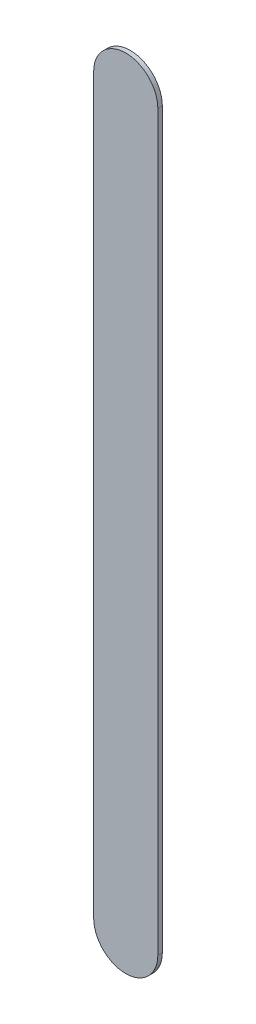
ISO-10303-21;
HEADER;
FILE_DESCRIPTION(('STEP AP214'),'2;1');
FILE_NAME('part.step','',(''),(''),'','','');
FILE_SCHEMA(('AUTOMOTIVE_DESIGN { 1 0 10303 214 1 1 1 1 }'));
ENDSEC;
DATA;
#1=APPLICATION_CONTEXT('core data for automotive mechanical design processes');
#2=APPLICATION_PROTOCOL_DEFINITION('international standard','automotive_design',2000,#1);
#3=PRODUCT_CONTEXT('',#1,'mechanical');
#4=PRODUCT('Part','Part','',(#3));
#5=PRODUCT_RELATED_PRODUCT_CATEGORY('part','',(#4));
#6=PRODUCT_DEFINITION_FORMATION('','',#4);
#7=PRODUCT_DEFINITION_CONTEXT('part definition',#1,'design');
#8=PRODUCT_DEFINITION('design','',#6,#7);
#9=PRODUCT_DEFINITION_SHAPE('','',#8);
#10=(LENGTH_UNIT() NAMED_UNIT(*) SI_UNIT(.MILLI.,.METRE.));
#11=(NAMED_UNIT(*) PLANE_ANGLE_UNIT() SI_UNIT($,.RADIAN.));
#12=(NAMED_UNIT(*) SI_UNIT($,.STERADIAN.) SOLID_ANGLE_UNIT());
#13=UNCERTAINTY_MEASURE_WITH_UNIT(LENGTH_MEASURE(1.E-05),#10,'distance_accuracy_value','');
#14=(GEOMETRIC_REPRESENTATION_CONTEXT(3) GLOBAL_UNCERTAINTY_ASSIGNED_CONTEXT((#13)) GLOBAL_UNIT_ASSIGNED_CONTEXT((#10,
#11,#12)) REPRESENTATION_CONTEXT('',''));
#15=CARTESIAN_POINT('',(0.,0.,0.));
#16=DIRECTION('',(0.,0.,1.));
#17=DIRECTION('',(1.,0.,0.));
#18=AXIS2_PLACEMENT_3D('',#15,#16,#17);
#19=CARTESIAN_POINT('',(173.994,-116.332,0.));
#20=DIRECTION('',(0.,0.,1.));
#21=DIRECTION('',(1.,0.,0.));
#22=AXIS2_PLACEMENT_3D('',#19,#20,#21);
#23=PLANE('',#22);
#24=DIRECTION('',(0.,-1.,0.));
#25=VECTOR('',#24,1.);
#26=CARTESIAN_POINT('',(173.994,-116.332,0.));
#27=LINE('',#26,#25);
#28=CARTESIAN_POINT('',(173.994,-116.332,0.));
#29=VERTEX_POINT('',#28);
#30=CARTESIAN_POINT('',(173.994,-122.047,0.));
#31=VERTEX_POINT('',#30);
#32=EDGE_CURVE('E71',#29,#31,#27,.T.);
#33=ORIENTED_EDGE('',*,*,#32,.T.);
#34=CARTESIAN_POINT('',(174.244,-122.047,0.));
#35=DIRECTION('',(0.,0.,1.));
#36=DIRECTION('',(-1.,0.,0.));
#37=AXIS2_PLACEMENT_3D('',#34,#35,#36);
#38=CIRCLE('',#37,0.25);
#39=CARTESIAN_POINT('',(174.494,-122.047,0.));
#40=VERTEX_POINT('',#39);
#41=EDGE_CURVE('E69',#31,#40,#38,.T.);
#42=ORIENTED_EDGE('',*,*,#41,.T.);
#43=DIRECTION('',(0.,1.,0.));
#44=VECTOR('',#43,1.);
#45=CARTESIAN_POINT('',(174.494,-122.047,0.));
#46=LINE('',#45,#44);
#47=CARTESIAN_POINT('',(174.494,-116.332,0.));
#48=VERTEX_POINT('',#47);
#49=EDGE_CURVE('E56',#40,#48,#46,.T.);
#50=ORIENTED_EDGE('',*,*,#49,.T.);
#51=CARTESIAN_POINT('',(174.244,-116.332,0.));
#52=DIRECTION('',(0.,0.,1.));
#53=DIRECTION('',(1.,0.,0.));
#54=AXIS2_PLACEMENT_3D('',#51,#52,#53);
#55=CIRCLE('',#54,0.25);
#56=EDGE_CURVE('E11',#48,#29,#55,.T.);
#57=ORIENTED_EDGE('',*,*,#56,.T.);
#58=EDGE_LOOP('',(#33,#42,#50,#57));
#59=FACE_BOUND('',#58,.T.);
#60=ADVANCED_FACE('F17',(#59),#23,.T.);
#61=CARTESIAN_POINT('',(173.994,-116.332,-0.035));
#62=DIRECTION('',(0.,0.,1.));
#63=DIRECTION('',(1.,0.,0.));
#64=AXIS2_PLACEMENT_3D('',#61,#62,#63);
#65=PLANE('',#64);
#66=CARTESIAN_POINT('',(174.244,-116.332,-0.035));
#67=DIRECTION('',(0.,0.,1.));
#68=DIRECTION('',(1.,0.,0.));
#69=AXIS2_PLACEMENT_3D('',#66,#67,#68);
#70=CIRCLE('',#69,0.25);
#71=CARTESIAN_POINT('',(174.494,-116.332,-0.035));
#72=VERTEX_POINT('',#71);
#73=CARTESIAN_POINT('',(173.994,-116.332,-0.035));
#74=VERTEX_POINT('',#73);
#75=EDGE_CURVE('E26',#72,#74,#70,.T.);
#76=ORIENTED_EDGE('',*,*,#75,.F.);
#77=DIRECTION('',(0.,1.,0.));
#78=VECTOR('',#77,1.);
#79=CARTESIAN_POINT('',(174.494,-122.047,-0.035));
#80=LINE('',#79,#78);
#81=CARTESIAN_POINT('',(174.494,-122.047,-0.035));
#82=VERTEX_POINT('',#81);
#83=EDGE_CURVE('E76',#82,#72,#80,.T.);
#84=ORIENTED_EDGE('',*,*,#83,.F.);
#85=CARTESIAN_POINT('',(174.244,-122.047,-0.035));
#86=DIRECTION('',(0.,0.,1.));
#87=DIRECTION('',(-1.,0.,0.));
#88=AXIS2_PLACEMENT_3D('',#85,#86,#87);
#89=CIRCLE('',#88,0.25);
#90=CARTESIAN_POINT('',(173.994,-122.047,-0.035));
#91=VERTEX_POINT('',#90);
#92=EDGE_CURVE('E80',#91,#82,#89,.T.);
#93=ORIENTED_EDGE('',*,*,#92,.F.);
#94=DIRECTION('',(0.,-1.,0.));
#95=VECTOR('',#94,1.);
#96=CARTESIAN_POINT('',(173.994,-116.332,-0.035));
#97=LINE('',#96,#95);
#98=EDGE_CURVE('E113',#74,#91,#97,.T.);
#99=ORIENTED_EDGE('',*,*,#98,.F.);
#100=EDGE_LOOP('',(#76,#84,#93,#99));
#101=FACE_BOUND('',#100,.T.);
#102=ADVANCED_FACE('F114',(#101),#65,.F.);
#103=CARTESIAN_POINT('',(174.244,-116.332,-0.035));
#104=DIRECTION('',(0.,0.,-1.));
#105=DIRECTION('',(1.,0.,0.));
#106=AXIS2_PLACEMENT_3D('',#103,#104,#105);
#107=CYLINDRICAL_SURFACE('',#106,0.25);
#108=ORIENTED_EDGE('',*,*,#75,.T.);
#109=DIRECTION('',(0.,0.,1.));
#110=VECTOR('',#109,1.);
#111=CARTESIAN_POINT('',(173.994,-116.332,-0.035));
#112=LINE('',#111,#110);
#113=EDGE_CURVE('E87',#74,#29,#112,.T.);
#114=ORIENTED_EDGE('',*,*,#113,.T.);
#115=ORIENTED_EDGE('',*,*,#56,.F.);
#116=DIRECTION('',(0.,0.,1.));
#117=VECTOR('',#116,1.);
#118=CARTESIAN_POINT('',(174.494,-116.332,-0.035));
#119=LINE('',#118,#117);
#120=EDGE_CURVE('E63',#72,#48,#119,.T.);
#121=ORIENTED_EDGE('',*,*,#120,.F.);
#122=EDGE_LOOP('',(#108,#114,#115,#121));
#123=FACE_BOUND('',#122,.T.);
#124=ADVANCED_FACE('F104',(#123),#107,.T.);
#125=CARTESIAN_POINT('',(174.494,-122.047,-0.035));
#126=DIRECTION('',(-1.,0.,0.));
#127=DIRECTION('',(0.,0.,1.));
#128=AXIS2_PLACEMENT_3D('',#125,#126,#127);
#129=PLANE('',#128);
#130=ORIENTED_EDGE('',*,*,#83,.T.);
#131=ORIENTED_EDGE('',*,*,#120,.T.);
#132=ORIENTED_EDGE('',*,*,#49,.F.);
#133=DIRECTION('',(0.,0.,1.));
#134=VECTOR('',#133,1.);
#135=CARTESIAN_POINT('',(174.494,-122.047,-0.035));
#136=LINE('',#135,#134);
#137=EDGE_CURVE('E61',#82,#40,#136,.T.);
#138=ORIENTED_EDGE('',*,*,#137,.F.);
#139=EDGE_LOOP('',(#130,#131,#132,#138));
#140=FACE_BOUND('',#139,.T.);
#141=ADVANCED_FACE('F59',(#140),#129,.F.);
#142=CARTESIAN_POINT('',(174.244,-122.047,-0.035));
#143=DIRECTION('',(0.,0.,-1.));
#144=DIRECTION('',(-1.,0.,0.));
#145=AXIS2_PLACEMENT_3D('',#142,#143,#144);
#146=CYLINDRICAL_SURFACE('',#145,0.25);
#147=ORIENTED_EDGE('',*,*,#92,.T.);
#148=ORIENTED_EDGE('',*,*,#137,.T.);
#149=ORIENTED_EDGE('',*,*,#41,.F.);
#150=DIRECTION('',(0.,0.,1.));
#151=VECTOR('',#150,1.);
#152=CARTESIAN_POINT('',(173.994,-122.047,-0.035));
#153=LINE('',#152,#151);
#154=EDGE_CURVE('E91',#91,#31,#153,.T.);
#155=ORIENTED_EDGE('',*,*,#154,.F.);
#156=EDGE_LOOP('',(#147,#148,#149,#155));
#157=FACE_BOUND('',#156,.T.);
#158=ADVANCED_FACE('F78',(#157),#146,.T.);
#159=CARTESIAN_POINT('',(173.994,-116.332,-0.035));
#160=DIRECTION('',(1.,0.,0.));
#161=DIRECTION('',(0.,1.,0.));
#162=AXIS2_PLACEMENT_3D('',#159,#160,#161);
#163=PLANE('',#162);
#164=ORIENTED_EDGE('',*,*,#98,.T.);
#165=ORIENTED_EDGE('',*,*,#154,.T.);
#166=ORIENTED_EDGE('',*,*,#32,.F.);
#167=ORIENTED_EDGE('',*,*,#113,.F.);
#168=EDGE_LOOP('',(#164,#165,#166,#167));
#169=FACE_BOUND('',#168,.T.);
#170=ADVANCED_FACE('F112',(#169),#163,.F.);
#171=CLOSED_SHELL('',(#60,#102,#124,#141,#158,#170));
#172=MANIFOLD_SOLID_BREP('B1',#171);
#173=ADVANCED_BREP_SHAPE_REPRESENTATION('',(#18,#172),#14);
#174=SHAPE_DEFINITION_REPRESENTATION(#9,#173);
ENDSEC;
END-ISO-10303-21;
